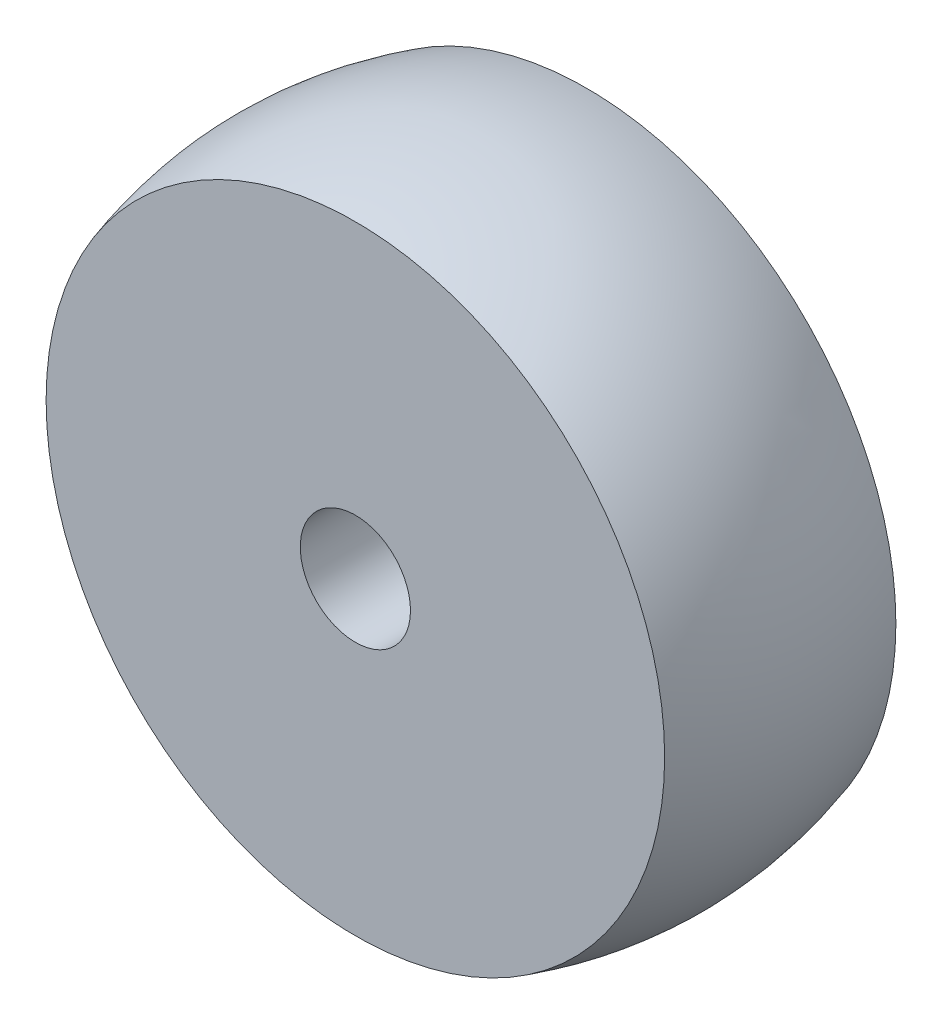
ISO-10303-21;
HEADER;
FILE_DESCRIPTION(('STEP AP214'),'2;1');
FILE_NAME('part.step','',(''),(''),'','','');
FILE_SCHEMA(('AUTOMOTIVE_DESIGN { 1 0 10303 214 1 1 1 1 }'));
ENDSEC;
DATA;
#1=APPLICATION_CONTEXT('core data for automotive mechanical design processes');
#2=APPLICATION_PROTOCOL_DEFINITION('international standard','automotive_design',2000,#1);
#3=PRODUCT_CONTEXT('',#1,'mechanical');
#4=PRODUCT('Part','Part','',(#3));
#5=PRODUCT_RELATED_PRODUCT_CATEGORY('part','',(#4));
#6=PRODUCT_DEFINITION_FORMATION('','',#4);
#7=PRODUCT_DEFINITION_CONTEXT('part definition',#1,'design');
#8=PRODUCT_DEFINITION('design','',#6,#7);
#9=PRODUCT_DEFINITION_SHAPE('','',#8);
#10=(LENGTH_UNIT() NAMED_UNIT(*) SI_UNIT(.MILLI.,.METRE.));
#11=(NAMED_UNIT(*) PLANE_ANGLE_UNIT() SI_UNIT($,.RADIAN.));
#12=(NAMED_UNIT(*) SI_UNIT($,.STERADIAN.) SOLID_ANGLE_UNIT());
#13=UNCERTAINTY_MEASURE_WITH_UNIT(LENGTH_MEASURE(1.E-05),#10,'distance_accuracy_value','');
#14=(GEOMETRIC_REPRESENTATION_CONTEXT(3) GLOBAL_UNCERTAINTY_ASSIGNED_CONTEXT((#13)) GLOBAL_UNIT_ASSIGNED_CONTEXT((#10,
#11,#12)) REPRESENTATION_CONTEXT('',''));
#15=CARTESIAN_POINT('',(0.,0.,0.));
#16=DIRECTION('',(0.,0.,1.));
#17=DIRECTION('',(1.,0.,0.));
#18=AXIS2_PLACEMENT_3D('',#15,#16,#17);
#19=CARTESIAN_POINT('',(0.,0.,20.));
#20=DIRECTION('',(0.,0.,1.));
#21=DIRECTION('',(1.,0.,0.));
#22=AXIS2_PLACEMENT_3D('',#19,#20,#21);
#23=PLANE('',#22);
#24=CARTESIAN_POINT('',(0.,0.,20.));
#25=DIRECTION('',(0.,0.,-1.));
#26=DIRECTION('',(-1.,0.,0.));
#27=AXIS2_PLACEMENT_3D('',#24,#25,#26);
#28=CIRCLE('',#27,26.75);
#29=CARTESIAN_POINT('',(-26.75,0.,20.));
#30=VERTEX_POINT('',#29);
#31=EDGE_CURVE('E47',#30,#30,#28,.T.);
#32=ORIENTED_EDGE('',*,*,#31,.F.);
#33=EDGE_LOOP('',(#32));
#34=FACE_BOUND('',#33,.T.);
#35=CARTESIAN_POINT('',(0.,0.,20.));
#36=DIRECTION('',(0.,0.,1.));
#37=DIRECTION('',(1.,0.,0.));
#38=AXIS2_PLACEMENT_3D('',#35,#36,#37);
#39=CIRCLE('',#38,4.765);
#40=CARTESIAN_POINT('',(4.765,0.,20.));
#41=VERTEX_POINT('',#40);
#42=EDGE_CURVE('E38',#41,#41,#39,.T.);
#43=ORIENTED_EDGE('',*,*,#42,.F.);
#44=EDGE_LOOP('',(#43));
#45=FACE_BOUND('',#44,.T.);
#46=ADVANCED_FACE('F31',(#34,#45),#23,.T.);
#47=CARTESIAN_POINT('',(0.,0.,0.));
#48=DIRECTION('',(0.,0.,1.));
#49=DIRECTION('',(1.,0.,0.));
#50=AXIS2_PLACEMENT_3D('',#47,#48,#49);
#51=PLANE('',#50);
#52=CARTESIAN_POINT('',(0.,0.,0.));
#53=DIRECTION('',(0.,0.,1.));
#54=DIRECTION('',(1.,0.,0.));
#55=AXIS2_PLACEMENT_3D('',#52,#53,#54);
#56=CIRCLE('',#55,26.75);
#57=CARTESIAN_POINT('',(26.75,0.,0.));
#58=VERTEX_POINT('',#57);
#59=EDGE_CURVE('E10',#58,#58,#56,.T.);
#60=ORIENTED_EDGE('',*,*,#59,.F.);
#61=EDGE_LOOP('',(#60));
#62=FACE_BOUND('',#61,.T.);
#63=CARTESIAN_POINT('',(0.,0.,0.));
#64=DIRECTION('',(0.,0.,1.));
#65=DIRECTION('',(1.,0.,0.));
#66=AXIS2_PLACEMENT_3D('',#63,#64,#65);
#67=CIRCLE('',#66,4.765);
#68=CARTESIAN_POINT('',(4.765,0.,0.));
#69=VERTEX_POINT('',#68);
#70=EDGE_CURVE('E42',#69,#69,#67,.T.);
#71=ORIENTED_EDGE('',*,*,#70,.T.);
#72=EDGE_LOOP('',(#71));
#73=FACE_BOUND('',#72,.T.);
#74=ADVANCED_FACE('F33',(#62,#73),#51,.F.);
#75=CARTESIAN_POINT('',(0.,0.,20.));
#76=DIRECTION('',(0.,0.,-1.));
#77=DIRECTION('',(-1.,0.,0.));
#78=AXIS2_PLACEMENT_3D('',#75,#76,#77);
#79=CYLINDRICAL_SURFACE('',#78,4.765);
#80=ORIENTED_EDGE('',*,*,#42,.T.);
#81=EDGE_LOOP('',(#80));
#82=FACE_BOUND('',#81,.T.);
#83=ORIENTED_EDGE('',*,*,#70,.F.);
#84=EDGE_LOOP('',(#83));
#85=FACE_BOUND('',#84,.T.);
#86=ADVANCED_FACE('F61',(#82,#85),#79,.F.);
#87=CARTESIAN_POINT('',(0.,26.75,0.));
#88=CARTESIAN_POINT('',(0.,29.75,10.));
#89=CARTESIAN_POINT('',(0.,26.75,20.));
#90=B_SPLINE_CURVE_WITH_KNOTS('',2,(#87,#88,#89),.UNSPECIFIED.,.F.,.F.,(3,3),(0.,1.),.UNSPECIFIED.);
#91=CARTESIAN_POINT('',(0.,0.,0.));
#92=DIRECTION('',(0.,0.,-1.));
#93=AXIS1_PLACEMENT('',#91,#92);
#94=SURFACE_OF_REVOLUTION('',#90,#93);
#95=ORIENTED_EDGE('',*,*,#31,.T.);
#96=EDGE_LOOP('',(#95));
#97=FACE_BOUND('',#96,.T.);
#98=ORIENTED_EDGE('',*,*,#59,.T.);
#99=EDGE_LOOP('',(#98));
#100=FACE_BOUND('',#99,.T.);
#101=ADVANCED_FACE('F58',(#97,#100),#94,.F.);
#102=CLOSED_SHELL('',(#46,#74,#86,#101));
#103=MANIFOLD_SOLID_BREP('B2',#102);
#104=ADVANCED_BREP_SHAPE_REPRESENTATION('',(#18,#103),#14);
#105=SHAPE_DEFINITION_REPRESENTATION(#9,#104);
ENDSEC;
END-ISO-10303-21;
